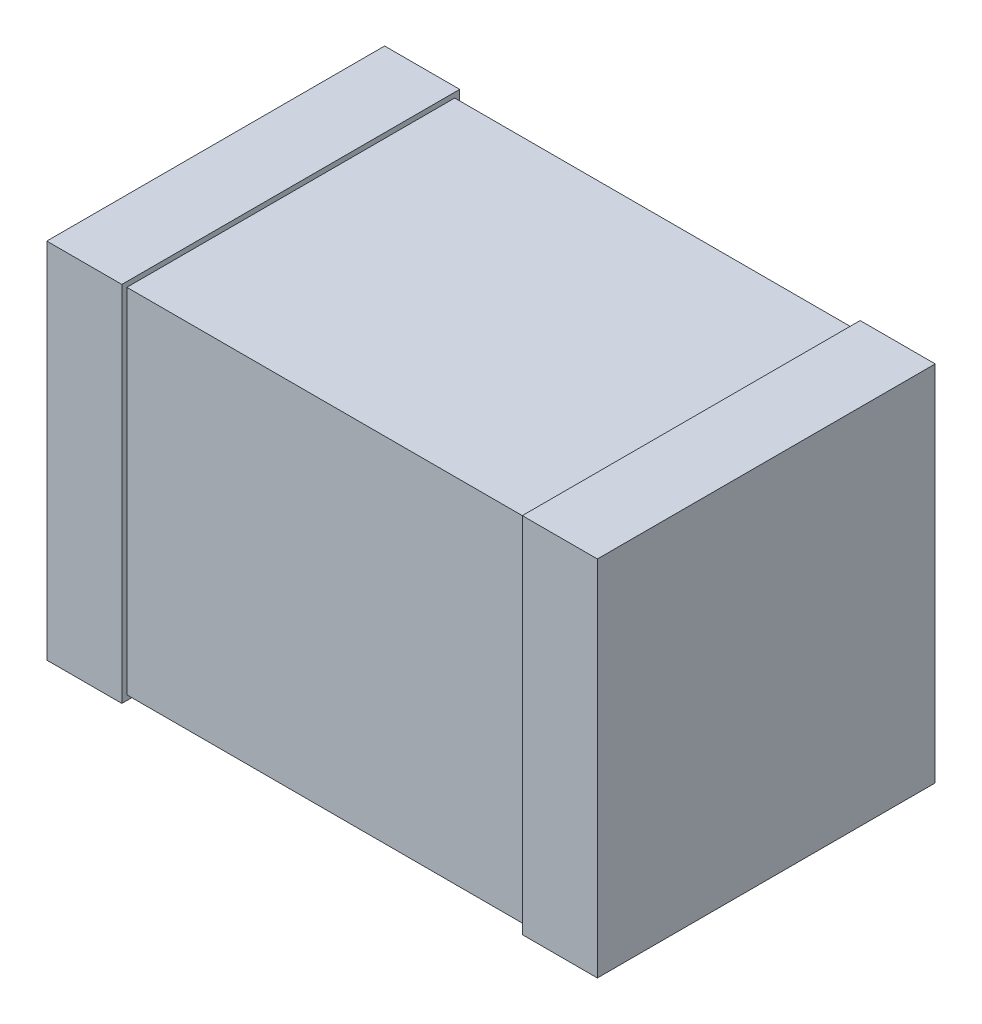
ISO-10303-21;
HEADER;
FILE_DESCRIPTION(('STEP AP214'),'2;1');
FILE_NAME('part.step','',(''),(''),'','','');
FILE_SCHEMA(('AUTOMOTIVE_DESIGN { 1 0 10303 214 1 1 1 1 }'));
ENDSEC;
DATA;
#1=APPLICATION_CONTEXT('core data for automotive mechanical design processes');
#2=APPLICATION_PROTOCOL_DEFINITION('international standard','automotive_design',2000,#1);
#3=PRODUCT_CONTEXT('',#1,'mechanical');
#4=PRODUCT('Part','Part','',(#3));
#5=PRODUCT_RELATED_PRODUCT_CATEGORY('part','',(#4));
#6=PRODUCT_DEFINITION_FORMATION('','',#4);
#7=PRODUCT_DEFINITION_CONTEXT('part definition',#1,'design');
#8=PRODUCT_DEFINITION('design','',#6,#7);
#9=PRODUCT_DEFINITION_SHAPE('','',#8);
#10=(LENGTH_UNIT() NAMED_UNIT(*) SI_UNIT(.MILLI.,.METRE.));
#11=(NAMED_UNIT(*) PLANE_ANGLE_UNIT() SI_UNIT($,.RADIAN.));
#12=(NAMED_UNIT(*) SI_UNIT($,.STERADIAN.) SOLID_ANGLE_UNIT());
#13=UNCERTAINTY_MEASURE_WITH_UNIT(LENGTH_MEASURE(1.E-05),#10,'distance_accuracy_value','');
#14=(GEOMETRIC_REPRESENTATION_CONTEXT(3) GLOBAL_UNCERTAINTY_ASSIGNED_CONTEXT((#13)) GLOBAL_UNIT_ASSIGNED_CONTEXT((#10,
#11,#12)) REPRESENTATION_CONTEXT('',''));
#15=CARTESIAN_POINT('',(0.,0.,0.));
#16=DIRECTION('',(0.,0.,1.));
#17=DIRECTION('',(1.,0.,0.));
#18=AXIS2_PLACEMENT_3D('',#15,#16,#17);
#19=CARTESIAN_POINT('',(-1.099999999894,0.725,291599.6664351));
#20=DIRECTION('',(-1.,0.,0.));
#21=DIRECTION('',(0.,0.,1.));
#22=AXIS2_PLACEMENT_3D('',#19,#20,#21);
#23=PLANE('',#22);
#24=DIRECTION('',(0.,0.,-1.));
#25=VECTOR('',#24,1.);
#26=CARTESIAN_POINT('',(-1.100000000008,0.725,1.081267326829E-11));
#27=LINE('',#26,#25);
#28=CARTESIAN_POINT('',(-1.10000000000294,0.725,1.35000000000205));
#29=VERTEX_POINT('',#28);
#30=CARTESIAN_POINT('',(-1.10000000000297,0.725,8.109504951247E-12));
#31=VERTEX_POINT('',#30);
#32=EDGE_CURVE('E116',#29,#31,#27,.T.);
#33=ORIENTED_EDGE('',*,*,#32,.T.);
#34=DIRECTION('',(0.,1.,0.));
#35=VECTOR('',#34,1.);
#36=CARTESIAN_POINT('',(-1.10000000000809,0.725,1.0812673268349E-11));
#37=LINE('',#36,#35);
#38=CARTESIAN_POINT('',(-1.10000000000294,-0.725,8.10950495123225E-12));
#39=VERTEX_POINT('',#38);
#40=EDGE_CURVE('E103',#39,#31,#37,.T.);
#41=ORIENTED_EDGE('',*,*,#40,.F.);
#42=DIRECTION('',(0.,0.,-1.));
#43=VECTOR('',#42,1.);
#44=CARTESIAN_POINT('',(-1.100000000008,-0.725,1.081267326829E-11));
#45=LINE('',#44,#43);
#46=CARTESIAN_POINT('',(-1.10000000000294,-0.725,1.35000000000205));
#47=VERTEX_POINT('',#46);
#48=EDGE_CURVE('E20',#47,#39,#45,.T.);
#49=ORIENTED_EDGE('',*,*,#48,.F.);
#50=DIRECTION('',(0.,1.,0.));
#51=VECTOR('',#50,1.);
#52=CARTESIAN_POINT('',(-1.10000000000809,0.725,1.350000000002));
#53=LINE('',#52,#51);
#54=EDGE_CURVE('E131',#29,#47,#53,.F.);
#55=ORIENTED_EDGE('',*,*,#54,.F.);
#56=EDGE_LOOP('',(#33,#41,#49,#55));
#57=FACE_BOUND('',#56,.T.);
#58=ADVANCED_FACE('F17',(#57),#23,.T.);
#59=CARTESIAN_POINT('',(1.100000000008,0.725,291599.6664351));
#60=DIRECTION('',(1.,0.,0.));
#61=DIRECTION('',(0.,0.,-1.));
#62=AXIS2_PLACEMENT_3D('',#59,#60,#61);
#63=PLANE('',#62);
#64=DIRECTION('',(0.,0.,-1.));
#65=VECTOR('',#64,1.);
#66=CARTESIAN_POINT('',(1.100000000008,0.725,1.350000000002));
#67=LINE('',#66,#65);
#68=CARTESIAN_POINT('',(1.10000000000802,0.725,3.6781016600615E-12));
#69=VERTEX_POINT('',#68);
#70=CARTESIAN_POINT('',(1.10000000000805,0.725,1.35000000000205));
#71=VERTEX_POINT('',#70);
#72=EDGE_CURVE('E142',#69,#71,#67,.F.);
#73=ORIENTED_EDGE('',*,*,#72,.T.);
#74=DIRECTION('',(0.,1.,0.));
#75=VECTOR('',#74,1.);
#76=CARTESIAN_POINT('',(1.10000000000809,0.725,1.350000000002));
#77=LINE('',#76,#75);
#78=CARTESIAN_POINT('',(1.10000000000802,-0.725,1.35000000000205));
#79=VERTEX_POINT('',#78);
#80=EDGE_CURVE('E138',#79,#71,#77,.T.);
#81=ORIENTED_EDGE('',*,*,#80,.F.);
#82=DIRECTION('',(0.,0.,-1.));
#83=VECTOR('',#82,1.);
#84=CARTESIAN_POINT('',(1.100000000008,-0.725,1.350000000002));
#85=LINE('',#84,#83);
#86=CARTESIAN_POINT('',(1.10000000000802,-0.725,3.6781016600615E-12));
#87=VERTEX_POINT('',#86);
#88=EDGE_CURVE('E133',#87,#79,#85,.F.);
#89=ORIENTED_EDGE('',*,*,#88,.F.);
#90=DIRECTION('',(0.,1.,0.));
#91=VECTOR('',#90,1.);
#92=CARTESIAN_POINT('',(1.10000000000809,0.725,4.90428010707313E-12));
#93=LINE('',#92,#91);
#94=EDGE_CURVE('E151',#69,#87,#93,.F.);
#95=ORIENTED_EDGE('',*,*,#94,.F.);
#96=EDGE_LOOP('',(#73,#81,#89,#95));
#97=FACE_BOUND('',#96,.T.);
#98=ADVANCED_FACE('F272',(#97),#63,.T.);
#99=CARTESIAN_POINT('',(-1.100000000008,-0.725,1.081267326829E-11));
#100=DIRECTION('',(0.,-1.,0.));
#101=DIRECTION('',(0.,0.,-1.));
#102=AXIS2_PLACEMENT_3D('',#99,#100,#101);
#103=PLANE('',#102);
#104=DIRECTION('',(0.,0.,-1.));
#105=VECTOR('',#104,1.);
#106=CARTESIAN_POINT('',(-0.799999999913,-0.725,291599.6664351));
#107=LINE('',#106,#105);
#108=CARTESIAN_POINT('',(-0.800000000011808,-0.725,1.35000000000205));
#109=VERTEX_POINT('',#108);
#110=CARTESIAN_POINT('',(-0.800000000011808,-0.725,8.10943237142164E-12));
#111=VERTEX_POINT('',#110);
#112=EDGE_CURVE('E154',#109,#111,#107,.T.);
#113=ORIENTED_EDGE('',*,*,#112,.F.);
#114=DIRECTION('',(1.,0.,0.));
#115=VECTOR('',#114,1.);
#116=CARTESIAN_POINT('',(-400000.,-0.725,1.350000000002));
#117=LINE('',#116,#115);
#118=EDGE_CURVE('E112',#47,#109,#117,.T.);
#119=ORIENTED_EDGE('',*,*,#118,.F.);
#120=ORIENTED_EDGE('',*,*,#48,.T.);
#121=DIRECTION('',(-1.,0.,0.));
#122=VECTOR('',#121,1.);
#123=CARTESIAN_POINT('',(-400000.,-0.725,3.979039320257E-10));
#124=LINE('',#123,#122);
#125=EDGE_CURVE('E109',#111,#39,#124,.T.);
#126=ORIENTED_EDGE('',*,*,#125,.F.);
#127=EDGE_LOOP('',(#113,#119,#120,#126));
#128=FACE_BOUND('',#127,.T.);
#129=ADVANCED_FACE('F108',(#128),#103,.T.);
#130=CARTESIAN_POINT('',(-400000.,0.725,3.979039320257E-10));
#131=DIRECTION('',(0.,0.,-1.));
#132=DIRECTION('',(-1.,0.,0.));
#133=AXIS2_PLACEMENT_3D('',#130,#131,#132);
#134=PLANE('',#133);
#135=DIRECTION('',(1.,0.,0.));
#136=VECTOR('',#135,1.);
#137=CARTESIAN_POINT('',(-1.100000000008,0.725,1.081267326829E-11));
#138=LINE('',#137,#136);
#139=CARTESIAN_POINT('',(-0.800000000016697,0.725,8.10935979162579E-12));
#140=VERTEX_POINT('',#139);
#141=EDGE_CURVE('E118',#31,#140,#138,.T.);
#142=ORIENTED_EDGE('',*,*,#141,.T.);
#143=DIRECTION('',(0.,1.,0.));
#144=VECTOR('',#143,1.);
#145=CARTESIAN_POINT('',(-0.800000000006675,0.725,0.));
#146=LINE('',#145,#144);
#147=EDGE_CURVE('E122',#111,#140,#146,.T.);
#148=ORIENTED_EDGE('',*,*,#147,.F.);
#149=ORIENTED_EDGE('',*,*,#125,.T.);
#150=ORIENTED_EDGE('',*,*,#40,.T.);
#151=EDGE_LOOP('',(#142,#148,#149,#150));
#152=FACE_BOUND('',#151,.T.);
#153=ADVANCED_FACE('F120',(#152),#134,.T.);
#154=CARTESIAN_POINT('',(-1.100000000008,0.725,1.081267326829E-11));
#155=DIRECTION('',(0.,-1.,0.));
#156=DIRECTION('',(0.,0.,-1.));
#157=AXIS2_PLACEMENT_3D('',#154,#155,#156);
#158=PLANE('',#157);
#159=DIRECTION('',(1.,0.,0.));
#160=VECTOR('',#159,1.);
#161=CARTESIAN_POINT('',(-400000.,0.725,1.350000000002));
#162=LINE('',#161,#160);
#163=CARTESIAN_POINT('',(-0.800000000011808,0.725,1.35000000000205));
#164=VERTEX_POINT('',#163);
#165=EDGE_CURVE('E128',#164,#29,#162,.F.);
#166=ORIENTED_EDGE('',*,*,#165,.F.);
#167=DIRECTION('',(0.,0.,-1.));
#168=VECTOR('',#167,1.);
#169=CARTESIAN_POINT('',(-0.799999999913,0.725,291599.6664351));
#170=LINE('',#169,#168);
#171=EDGE_CURVE('E157',#140,#164,#170,.F.);
#172=ORIENTED_EDGE('',*,*,#171,.F.);
#173=ORIENTED_EDGE('',*,*,#141,.F.);
#174=ORIENTED_EDGE('',*,*,#32,.F.);
#175=EDGE_LOOP('',(#166,#172,#173,#174));
#176=FACE_BOUND('',#175,.T.);
#177=ADVANCED_FACE('F224',(#176),#158,.F.);
#178=CARTESIAN_POINT('',(-400000.,0.725,1.350000000002));
#179=DIRECTION('',(0.,0.,1.));
#180=DIRECTION('',(1.,0.,0.));
#181=AXIS2_PLACEMENT_3D('',#178,#179,#180);
#182=PLANE('',#181);
#183=ORIENTED_EDGE('',*,*,#165,.T.);
#184=ORIENTED_EDGE('',*,*,#54,.T.);
#185=ORIENTED_EDGE('',*,*,#118,.T.);
#186=DIRECTION('',(0.,1.,0.));
#187=VECTOR('',#186,1.);
#188=CARTESIAN_POINT('',(-0.800000000006674,0.725,1.35000000000218));
#189=LINE('',#188,#187);
#190=EDGE_CURVE('E160',#164,#109,#189,.F.);
#191=ORIENTED_EDGE('',*,*,#190,.F.);
#192=EDGE_LOOP('',(#183,#184,#185,#191));
#193=FACE_BOUND('',#192,.T.);
#194=ADVANCED_FACE('F226',(#193),#182,.T.);
#195=CARTESIAN_POINT('',(1.100000000008,-0.725,1.350000000002));
#196=DIRECTION('',(0.,-1.,0.));
#197=DIRECTION('',(0.,0.,-1.));
#198=AXIS2_PLACEMENT_3D('',#195,#196,#197);
#199=PLANE('',#198);
#200=DIRECTION('',(0.,0.,1.));
#201=VECTOR('',#200,1.);
#202=CARTESIAN_POINT('',(0.800000000027,-0.725,291599.6664351));
#203=LINE('',#202,#201);
#204=CARTESIAN_POINT('',(0.800000000026889,-0.725,3.67804744995288E-12));
#205=VERTEX_POINT('',#204);
#206=CARTESIAN_POINT('',(0.800000000026889,-0.725,1.35000000000205));
#207=VERTEX_POINT('',#206);
#208=EDGE_CURVE('E170',#205,#207,#203,.T.);
#209=ORIENTED_EDGE('',*,*,#208,.F.);
#210=DIRECTION('',(-1.,0.,0.));
#211=VECTOR('',#210,1.);
#212=CARTESIAN_POINT('',(-400000.,-0.725,-2.84217094304E-10));
#213=LINE('',#212,#211);
#214=EDGE_CURVE('E145',#87,#205,#213,.T.);
#215=ORIENTED_EDGE('',*,*,#214,.F.);
#216=ORIENTED_EDGE('',*,*,#88,.T.);
#217=DIRECTION('',(1.,0.,0.));
#218=VECTOR('',#217,1.);
#219=CARTESIAN_POINT('',(-400000.,-0.725,1.350000000002));
#220=LINE('',#219,#218);
#221=EDGE_CURVE('E135',#207,#79,#220,.T.);
#222=ORIENTED_EDGE('',*,*,#221,.F.);
#223=EDGE_LOOP('',(#209,#215,#216,#222));
#224=FACE_BOUND('',#223,.T.);
#225=ADVANCED_FACE('F228',(#224),#199,.T.);
#226=CARTESIAN_POINT('',(-400000.,0.725,1.350000000002));
#227=DIRECTION('',(0.,0.,1.));
#228=DIRECTION('',(1.,0.,0.));
#229=AXIS2_PLACEMENT_3D('',#226,#227,#228);
#230=PLANE('',#229);
#231=DIRECTION('',(1.,0.,0.));
#232=VECTOR('',#231,1.);
#233=CARTESIAN_POINT('',(1.100000000008,0.725,1.350000000002));
#234=LINE('',#233,#232);
#235=CARTESIAN_POINT('',(0.800000000026779,0.725,1.35000000000205));
#236=VERTEX_POINT('',#235);
#237=EDGE_CURVE('E140',#71,#236,#234,.F.);
#238=ORIENTED_EDGE('',*,*,#237,.T.);
#239=DIRECTION('',(0.,1.,0.));
#240=VECTOR('',#239,1.);
#241=CARTESIAN_POINT('',(0.800000000027,0.725,1.35000000000218));
#242=LINE('',#241,#240);
#243=EDGE_CURVE('E173',#207,#236,#242,.T.);
#244=ORIENTED_EDGE('',*,*,#243,.F.);
#245=ORIENTED_EDGE('',*,*,#221,.T.);
#246=ORIENTED_EDGE('',*,*,#80,.T.);
#247=EDGE_LOOP('',(#238,#244,#245,#246));
#248=FACE_BOUND('',#247,.T.);
#249=ADVANCED_FACE('F235',(#248),#230,.T.);
#250=CARTESIAN_POINT('',(1.100000000008,0.725,1.350000000002));
#251=DIRECTION('',(0.,-1.,0.));
#252=DIRECTION('',(0.,0.,-1.));
#253=AXIS2_PLACEMENT_3D('',#250,#251,#252);
#254=PLANE('',#253);
#255=DIRECTION('',(-1.,0.,0.));
#256=VECTOR('',#255,1.);
#257=CARTESIAN_POINT('',(-400000.,0.725,-2.84217094304E-10));
#258=LINE('',#257,#256);
#259=CARTESIAN_POINT('',(0.800000000026889,0.725,3.67804744995288E-12));
#260=VERTEX_POINT('',#259);
#261=EDGE_CURVE('E148',#260,#69,#258,.F.);
#262=ORIENTED_EDGE('',*,*,#261,.F.);
#263=DIRECTION('',(0.,0.,1.));
#264=VECTOR('',#263,1.);
#265=CARTESIAN_POINT('',(0.800000000027,0.725,291599.6664351));
#266=LINE('',#265,#264);
#267=EDGE_CURVE('E176',#236,#260,#266,.F.);
#268=ORIENTED_EDGE('',*,*,#267,.F.);
#269=ORIENTED_EDGE('',*,*,#237,.F.);
#270=ORIENTED_EDGE('',*,*,#72,.F.);
#271=EDGE_LOOP('',(#262,#268,#269,#270));
#272=FACE_BOUND('',#271,.T.);
#273=ADVANCED_FACE('F255',(#272),#254,.F.);
#274=CARTESIAN_POINT('',(-400000.,0.725,-2.84217094304E-10));
#275=DIRECTION('',(0.,0.,-1.));
#276=DIRECTION('',(-1.,0.,0.));
#277=AXIS2_PLACEMENT_3D('',#274,#275,#276);
#278=PLANE('',#277);
#279=ORIENTED_EDGE('',*,*,#261,.T.);
#280=ORIENTED_EDGE('',*,*,#94,.T.);
#281=ORIENTED_EDGE('',*,*,#214,.T.);
#282=DIRECTION('',(0.,1.,0.));
#283=VECTOR('',#282,1.);
#284=CARTESIAN_POINT('',(0.800000000027,0.725,0.));
#285=LINE('',#284,#283);
#286=EDGE_CURVE('E179',#260,#205,#285,.F.);
#287=ORIENTED_EDGE('',*,*,#286,.F.);
#288=EDGE_LOOP('',(#279,#280,#281,#287));
#289=FACE_BOUND('',#288,.T.);
#290=ADVANCED_FACE('F252',(#289),#278,.T.);
#291=CARTESIAN_POINT('',(-400000.,0.705,0.02000000000635));
#292=DIRECTION('',(0.,0.,-1.));
#293=DIRECTION('',(-1.,0.,0.));
#294=AXIS2_PLACEMENT_3D('',#291,#292,#293);
#295=PLANE('',#294);
#296=DIRECTION('',(0.,1.,0.));
#297=VECTOR('',#296,1.);
#298=CARTESIAN_POINT('',(0.800000000027,0.725,0.0200000000063483));
#299=LINE('',#298,#297);
#300=CARTESIAN_POINT('',(0.800000000026889,-0.705,0.0200000000063496));
#301=VERTEX_POINT('',#300);
#302=CARTESIAN_POINT('',(0.800000000026889,0.705,0.0200000000063491));
#303=VERTEX_POINT('',#302);
#304=EDGE_CURVE('E185',#301,#303,#299,.T.);
#305=ORIENTED_EDGE('',*,*,#304,.F.);
#306=DIRECTION('',(1.,0.,0.));
#307=VECTOR('',#306,1.);
#308=CARTESIAN_POINT('',(-1.050000000021,-0.705,0.02000000000635));
#309=LINE('',#308,#307);
#310=CARTESIAN_POINT('',(-0.800000000011727,-0.705,0.0200000000063491));
#311=VERTEX_POINT('',#310);
#312=EDGE_CURVE('E168',#311,#301,#309,.T.);
#313=ORIENTED_EDGE('',*,*,#312,.F.);
#314=DIRECTION('',(0.,1.,0.));
#315=VECTOR('',#314,1.);
#316=CARTESIAN_POINT('',(-0.800000000006675,0.725,0.0200000000063483));
#317=LINE('',#316,#315);
#318=CARTESIAN_POINT('',(-0.800000000016727,0.705,0.0200000000063491));
#319=VERTEX_POINT('',#318);
#320=EDGE_CURVE('E163',#319,#311,#317,.F.);
#321=ORIENTED_EDGE('',*,*,#320,.F.);
#322=DIRECTION('',(1.,0.,0.));
#323=VECTOR('',#322,1.);
#324=CARTESIAN_POINT('',(-1.050000000021,0.705,0.02000000000635));
#325=LINE('',#324,#323);
#326=EDGE_CURVE('E191',#319,#303,#325,.T.);
#327=ORIENTED_EDGE('',*,*,#326,.T.);
#328=EDGE_LOOP('',(#305,#313,#321,#327));
#329=FACE_BOUND('',#328,.T.);
#330=ADVANCED_FACE('F211',(#329),#295,.T.);
#331=CARTESIAN_POINT('',(-0.799999999913,0.725,291599.6664351));
#332=DIRECTION('',(1.,0.,0.));
#333=DIRECTION('',(0.,0.,-1.));
#334=AXIS2_PLACEMENT_3D('',#331,#332,#333);
#335=PLANE('',#334);
#336=DIRECTION('',(0.,0.,-1.));
#337=VECTOR('',#336,1.);
#338=CARTESIAN_POINT('',(-0.800000000007,-0.705,1.329999999996));
#339=LINE('',#338,#337);
#340=CARTESIAN_POINT('',(-0.800000000011727,-0.705,1.32999999999592));
#341=VERTEX_POINT('',#340);
#342=EDGE_CURVE('E165',#341,#311,#339,.T.);
#343=ORIENTED_EDGE('',*,*,#342,.F.);
#344=DIRECTION('',(0.,1.,0.));
#345=VECTOR('',#344,1.);
#346=CARTESIAN_POINT('',(-0.800000000026557,0.705,1.329999999996));
#347=LINE('',#346,#345);
#348=CARTESIAN_POINT('',(-0.800000000016727,0.705,1.32999999999592));
#349=VERTEX_POINT('',#348);
#350=EDGE_CURVE('E194',#349,#341,#347,.F.);
#351=ORIENTED_EDGE('',*,*,#350,.F.);
#352=DIRECTION('',(0.,0.,-1.));
#353=VECTOR('',#352,1.);
#354=CARTESIAN_POINT('',(-0.800000000027,0.705,1.329999999996));
#355=LINE('',#354,#353);
#356=EDGE_CURVE('E188',#349,#319,#355,.T.);
#357=ORIENTED_EDGE('',*,*,#356,.T.);
#358=ORIENTED_EDGE('',*,*,#320,.T.);
#359=EDGE_LOOP('',(#343,#351,#357,#358));
#360=FACE_BOUND('',#359,.T.);
#361=ORIENTED_EDGE('',*,*,#171,.T.);
#362=ORIENTED_EDGE('',*,*,#190,.T.);
#363=ORIENTED_EDGE('',*,*,#112,.T.);
#364=ORIENTED_EDGE('',*,*,#147,.T.);
#365=EDGE_LOOP('',(#361,#362,#363,#364));
#366=FACE_BOUND('',#365,.T.);
#367=ADVANCED_FACE('F217',(#360,#366),#335,.T.);
#368=CARTESIAN_POINT('',(-1.050000000021,-0.705,1.329999999996));
#369=DIRECTION('',(0.,-1.,0.));
#370=DIRECTION('',(0.,0.,-1.));
#371=AXIS2_PLACEMENT_3D('',#368,#369,#370);
#372=PLANE('',#371);
#373=DIRECTION('',(0.,0.,1.));
#374=VECTOR('',#373,1.);
#375=CARTESIAN_POINT('',(0.800000000027,-0.705,291599.6664351));
#376=LINE('',#375,#374);
#377=CARTESIAN_POINT('',(0.800000000026889,-0.705,1.32999999999596));
#378=VERTEX_POINT('',#377);
#379=EDGE_CURVE('E182',#378,#301,#376,.F.);
#380=ORIENTED_EDGE('',*,*,#379,.F.);
#381=DIRECTION('',(1.,0.,0.));
#382=VECTOR('',#381,1.);
#383=CARTESIAN_POINT('',(-400000.,-0.705,1.329999999996));
#384=LINE('',#383,#382);
#385=EDGE_CURVE('E197',#341,#378,#384,.T.);
#386=ORIENTED_EDGE('',*,*,#385,.F.);
#387=ORIENTED_EDGE('',*,*,#342,.T.);
#388=ORIENTED_EDGE('',*,*,#312,.T.);
#389=EDGE_LOOP('',(#380,#386,#387,#388));
#390=FACE_BOUND('',#389,.T.);
#391=ADVANCED_FACE('F208',(#390),#372,.T.);
#392=CARTESIAN_POINT('',(0.800000000027,0.725,291599.6664351));
#393=DIRECTION('',(-1.,0.,0.));
#394=DIRECTION('',(0.,0.,1.));
#395=AXIS2_PLACEMENT_3D('',#392,#393,#394);
#396=PLANE('',#395);
#397=ORIENTED_EDGE('',*,*,#379,.T.);
#398=ORIENTED_EDGE('',*,*,#304,.T.);
#399=DIRECTION('',(0.,0.,-1.));
#400=VECTOR('',#399,1.);
#401=CARTESIAN_POINT('',(0.800000000027,0.705,1.329999999996));
#402=LINE('',#401,#400);
#403=CARTESIAN_POINT('',(0.800000000026889,0.705,1.32999999999592));
#404=VERTEX_POINT('',#403);
#405=EDGE_CURVE('E35',#303,#404,#402,.F.);
#406=ORIENTED_EDGE('',*,*,#405,.T.);
#407=DIRECTION('',(0.,1.,0.));
#408=VECTOR('',#407,1.);
#409=CARTESIAN_POINT('',(0.800000000026557,0.705,1.329999999996));
#410=LINE('',#409,#408);
#411=EDGE_CURVE('E26',#378,#404,#410,.T.);
#412=ORIENTED_EDGE('',*,*,#411,.F.);
#413=EDGE_LOOP('',(#397,#398,#406,#412));
#414=FACE_BOUND('',#413,.T.);
#415=ORIENTED_EDGE('',*,*,#267,.T.);
#416=ORIENTED_EDGE('',*,*,#286,.T.);
#417=ORIENTED_EDGE('',*,*,#208,.T.);
#418=ORIENTED_EDGE('',*,*,#243,.T.);
#419=EDGE_LOOP('',(#415,#416,#417,#418));
#420=FACE_BOUND('',#419,.T.);
#421=ADVANCED_FACE('F204',(#414,#420),#396,.T.);
#422=CARTESIAN_POINT('',(-1.050000000021,0.705,1.329999999996));
#423=DIRECTION('',(0.,-1.,0.));
#424=DIRECTION('',(0.,0.,-1.));
#425=AXIS2_PLACEMENT_3D('',#422,#423,#424);
#426=PLANE('',#425);
#427=ORIENTED_EDGE('',*,*,#356,.F.);
#428=DIRECTION('',(1.,0.,0.));
#429=VECTOR('',#428,1.);
#430=CARTESIAN_POINT('',(-400000.,0.705,1.329999999996));
#431=LINE('',#430,#429);
#432=EDGE_CURVE('E11',#404,#349,#431,.F.);
#433=ORIENTED_EDGE('',*,*,#432,.F.);
#434=ORIENTED_EDGE('',*,*,#405,.F.);
#435=ORIENTED_EDGE('',*,*,#326,.F.);
#436=EDGE_LOOP('',(#427,#433,#434,#435));
#437=FACE_BOUND('',#436,.T.);
#438=ADVANCED_FACE('F215',(#437),#426,.F.);
#439=CARTESIAN_POINT('',(-400000.,0.705,1.329999999996));
#440=DIRECTION('',(0.,0.,1.));
#441=DIRECTION('',(1.,0.,0.));
#442=AXIS2_PLACEMENT_3D('',#439,#440,#441);
#443=PLANE('',#442);
#444=ORIENTED_EDGE('',*,*,#411,.T.);
#445=ORIENTED_EDGE('',*,*,#432,.T.);
#446=ORIENTED_EDGE('',*,*,#350,.T.);
#447=ORIENTED_EDGE('',*,*,#385,.T.);
#448=EDGE_LOOP('',(#444,#445,#446,#447));
#449=FACE_BOUND('',#448,.T.);
#450=ADVANCED_FACE('F202',(#449),#443,.T.);
#451=CLOSED_SHELL('',(#58,#98,#129,#153,#177,#194,#225,#249,#273,#290,#330,#367,#391,#421,#438,#450));
#452=MANIFOLD_SOLID_BREP('B1',#451);
#453=ADVANCED_BREP_SHAPE_REPRESENTATION('',(#18,#452),#14);
#454=SHAPE_DEFINITION_REPRESENTATION(#9,#453);
ENDSEC;
END-ISO-10303-21;
